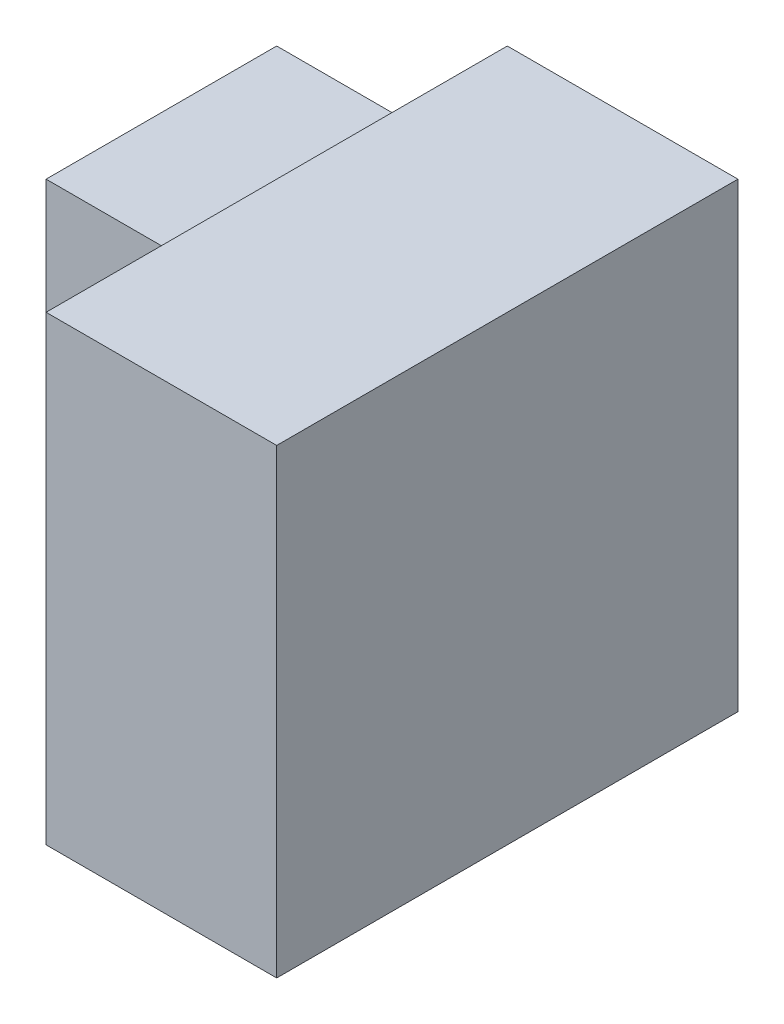
ISO-10303-21;
HEADER;
FILE_DESCRIPTION(('STEP AP214'),'2;1');
FILE_NAME('part.step','',(''),(''),'','','');
FILE_SCHEMA(('AUTOMOTIVE_DESIGN { 1 0 10303 214 1 1 1 1 }'));
ENDSEC;
DATA;
#1=APPLICATION_CONTEXT('core data for automotive mechanical design processes');
#2=APPLICATION_PROTOCOL_DEFINITION('international standard','automotive_design',2000,#1);
#3=PRODUCT_CONTEXT('',#1,'mechanical');
#4=PRODUCT('Part','Part','',(#3));
#5=PRODUCT_RELATED_PRODUCT_CATEGORY('part','',(#4));
#6=PRODUCT_DEFINITION_FORMATION('','',#4);
#7=PRODUCT_DEFINITION_CONTEXT('part definition',#1,'design');
#8=PRODUCT_DEFINITION('design','',#6,#7);
#9=PRODUCT_DEFINITION_SHAPE('','',#8);
#10=(LENGTH_UNIT() NAMED_UNIT(*) SI_UNIT(.MILLI.,.METRE.));
#11=(NAMED_UNIT(*) PLANE_ANGLE_UNIT() SI_UNIT($,.RADIAN.));
#12=(NAMED_UNIT(*) SI_UNIT($,.STERADIAN.) SOLID_ANGLE_UNIT());
#13=UNCERTAINTY_MEASURE_WITH_UNIT(LENGTH_MEASURE(1.E-05),#10,'distance_accuracy_value','');
#14=(GEOMETRIC_REPRESENTATION_CONTEXT(3) GLOBAL_UNCERTAINTY_ASSIGNED_CONTEXT((#13)) GLOBAL_UNIT_ASSIGNED_CONTEXT((#10,
#11,#12)) REPRESENTATION_CONTEXT('',''));
#15=CARTESIAN_POINT('',(0.,0.,0.));
#16=DIRECTION('',(0.,0.,1.));
#17=DIRECTION('',(1.,0.,0.));
#18=AXIS2_PLACEMENT_3D('',#15,#16,#17);
#19=CARTESIAN_POINT('',(2.,0.,0.));
#20=DIRECTION('',(0.,0.,-1.));
#21=DIRECTION('',(-1.,0.,0.));
#22=AXIS2_PLACEMENT_3D('',#19,#20,#21);
#23=PLANE('',#22);
#24=DIRECTION('',(0.,-1.,0.));
#25=VECTOR('',#24,1.);
#26=CARTESIAN_POINT('',(0.,0.,0.));
#27=LINE('',#26,#25);
#28=CARTESIAN_POINT('',(0.,4.,0.));
#29=VERTEX_POINT('',#28);
#30=CARTESIAN_POINT('',(0.,0.,0.));
#31=VERTEX_POINT('',#30);
#32=EDGE_CURVE('E133',#29,#31,#27,.T.);
#33=ORIENTED_EDGE('',*,*,#32,.T.);
#34=DIRECTION('',(-1.,0.,0.));
#35=VECTOR('',#34,1.);
#36=CARTESIAN_POINT('',(2.,0.,0.));
#37=LINE('',#36,#35);
#38=CARTESIAN_POINT('',(2.,0.,0.));
#39=VERTEX_POINT('',#38);
#40=EDGE_CURVE('E11',#39,#31,#37,.T.);
#41=ORIENTED_EDGE('',*,*,#40,.F.);
#42=DIRECTION('',(0.,-1.,0.));
#43=VECTOR('',#42,1.);
#44=CARTESIAN_POINT('',(2.,0.,0.));
#45=LINE('',#44,#43);
#46=CARTESIAN_POINT('',(2.,4.,0.));
#47=VERTEX_POINT('',#46);
#48=EDGE_CURVE('E151',#47,#39,#45,.T.);
#49=ORIENTED_EDGE('',*,*,#48,.F.);
#50=DIRECTION('',(-1.,0.,0.));
#51=VECTOR('',#50,1.);
#52=CARTESIAN_POINT('',(2.,4.,0.));
#53=LINE('',#52,#51);
#54=EDGE_CURVE('E152',#47,#29,#53,.T.);
#55=ORIENTED_EDGE('',*,*,#54,.T.);
#56=EDGE_LOOP('',(#33,#41,#49,#55));
#57=FACE_BOUND('',#56,.T.);
#58=ADVANCED_FACE('F33',(#57),#23,.F.);
#59=CARTESIAN_POINT('',(2.,0.,0.));
#60=DIRECTION('',(0.,1.,0.));
#61=DIRECTION('',(0.,0.,1.));
#62=AXIS2_PLACEMENT_3D('',#59,#60,#61);
#63=PLANE('',#62);
#64=DIRECTION('',(0.,0.,-1.));
#65=VECTOR('',#64,1.);
#66=CARTESIAN_POINT('',(0.,0.,0.));
#67=LINE('',#66,#65);
#68=CARTESIAN_POINT('',(0.,0.,-2.));
#69=VERTEX_POINT('',#68);
#70=EDGE_CURVE('E136',#31,#69,#67,.T.);
#71=ORIENTED_EDGE('',*,*,#70,.T.);
#72=DIRECTION('',(1.,0.,0.));
#73=VECTOR('',#72,1.);
#74=CARTESIAN_POINT('',(-2.,0.,-2.));
#75=LINE('',#74,#73);
#76=CARTESIAN_POINT('',(-2.,0.,-2.));
#77=VERTEX_POINT('',#76);
#78=EDGE_CURVE('E107',#77,#69,#75,.T.);
#79=ORIENTED_EDGE('',*,*,#78,.F.);
#80=DIRECTION('',(0.,0.,1.));
#81=VECTOR('',#80,1.);
#82=CARTESIAN_POINT('',(-2.,0.,-4.));
#83=LINE('',#82,#81);
#84=CARTESIAN_POINT('',(-2.,0.,-4.));
#85=VERTEX_POINT('',#84);
#86=EDGE_CURVE('E104',#85,#77,#83,.T.);
#87=ORIENTED_EDGE('',*,*,#86,.F.);
#88=DIRECTION('',(-1.,0.,0.));
#89=VECTOR('',#88,1.);
#90=CARTESIAN_POINT('',(2.,0.,-4.));
#91=LINE('',#90,#89);
#92=CARTESIAN_POINT('',(2.,0.,-4.));
#93=VERTEX_POINT('',#92);
#94=EDGE_CURVE('E41',#93,#85,#91,.T.);
#95=ORIENTED_EDGE('',*,*,#94,.F.);
#96=DIRECTION('',(0.,0.,-1.));
#97=VECTOR('',#96,1.);
#98=CARTESIAN_POINT('',(2.,0.,0.));
#99=LINE('',#98,#97);
#100=EDGE_CURVE('E168',#39,#93,#99,.T.);
#101=ORIENTED_EDGE('',*,*,#100,.F.);
#102=ORIENTED_EDGE('',*,*,#40,.T.);
#103=EDGE_LOOP('',(#71,#79,#87,#95,#101,#102));
#104=FACE_BOUND('',#103,.T.);
#105=ADVANCED_FACE('F105',(#104),#63,.F.);
#106=CARTESIAN_POINT('',(2.,0.,-4.));
#107=DIRECTION('',(0.,0.,1.));
#108=DIRECTION('',(1.,0.,0.));
#109=AXIS2_PLACEMENT_3D('',#106,#107,#108);
#110=PLANE('',#109);
#111=ORIENTED_EDGE('',*,*,#94,.T.);
#112=DIRECTION('',(0.,-1.,0.));
#113=VECTOR('',#112,1.);
#114=CARTESIAN_POINT('',(-2.,0.,-4.));
#115=LINE('',#114,#113);
#116=CARTESIAN_POINT('',(-2.,3.,-4.));
#117=VERTEX_POINT('',#116);
#118=EDGE_CURVE('E97',#117,#85,#115,.T.);
#119=ORIENTED_EDGE('',*,*,#118,.F.);
#120=DIRECTION('',(1.,0.,0.));
#121=VECTOR('',#120,1.);
#122=CARTESIAN_POINT('',(-2.,3.,-4.));
#123=LINE('',#122,#121);
#124=CARTESIAN_POINT('',(0.,3.,-4.));
#125=VERTEX_POINT('',#124);
#126=EDGE_CURVE('E122',#117,#125,#123,.T.);
#127=ORIENTED_EDGE('',*,*,#126,.T.);
#128=DIRECTION('',(0.,1.,0.));
#129=VECTOR('',#128,1.);
#130=CARTESIAN_POINT('',(0.,0.,-4.));
#131=LINE('',#130,#129);
#132=CARTESIAN_POINT('',(0.,4.,-4.));
#133=VERTEX_POINT('',#132);
#134=EDGE_CURVE('E55',#125,#133,#131,.T.);
#135=ORIENTED_EDGE('',*,*,#134,.T.);
#136=DIRECTION('',(-1.,0.,0.));
#137=VECTOR('',#136,1.);
#138=CARTESIAN_POINT('',(2.,4.,-4.));
#139=LINE('',#138,#137);
#140=CARTESIAN_POINT('',(2.,4.,-4.));
#141=VERTEX_POINT('',#140);
#142=EDGE_CURVE('E101',#141,#133,#139,.T.);
#143=ORIENTED_EDGE('',*,*,#142,.F.);
#144=DIRECTION('',(0.,1.,0.));
#145=VECTOR('',#144,1.);
#146=CARTESIAN_POINT('',(2.,0.,-4.));
#147=LINE('',#146,#145);
#148=EDGE_CURVE('E99',#93,#141,#147,.T.);
#149=ORIENTED_EDGE('',*,*,#148,.F.);
#150=EDGE_LOOP('',(#111,#119,#127,#135,#143,#149));
#151=FACE_BOUND('',#150,.T.);
#152=ADVANCED_FACE('F94',(#151),#110,.F.);
#153=CARTESIAN_POINT('',(2.,4.,0.));
#154=DIRECTION('',(0.,-1.,0.));
#155=DIRECTION('',(0.,0.,-1.));
#156=AXIS2_PLACEMENT_3D('',#153,#154,#155);
#157=PLANE('',#156);
#158=DIRECTION('',(0.,0.,1.));
#159=VECTOR('',#158,1.);
#160=CARTESIAN_POINT('',(0.,4.,0.));
#161=LINE('',#160,#159);
#162=EDGE_CURVE('E149',#133,#29,#161,.T.);
#163=ORIENTED_EDGE('',*,*,#162,.T.);
#164=ORIENTED_EDGE('',*,*,#54,.F.);
#165=DIRECTION('',(0.,0.,1.));
#166=VECTOR('',#165,1.);
#167=CARTESIAN_POINT('',(2.,4.,0.));
#168=LINE('',#167,#166);
#169=EDGE_CURVE('E155',#141,#47,#168,.T.);
#170=ORIENTED_EDGE('',*,*,#169,.F.);
#171=ORIENTED_EDGE('',*,*,#142,.T.);
#172=EDGE_LOOP('',(#163,#164,#170,#171));
#173=FACE_BOUND('',#172,.T.);
#174=ADVANCED_FACE('F159',(#173),#157,.F.);
#175=CARTESIAN_POINT('',(2.,0.,0.));
#176=DIRECTION('',(-1.,0.,0.));
#177=DIRECTION('',(0.,0.,1.));
#178=AXIS2_PLACEMENT_3D('',#175,#176,#177);
#179=PLANE('',#178);
#180=ORIENTED_EDGE('',*,*,#48,.T.);
#181=ORIENTED_EDGE('',*,*,#100,.T.);
#182=ORIENTED_EDGE('',*,*,#148,.T.);
#183=ORIENTED_EDGE('',*,*,#169,.T.);
#184=EDGE_LOOP('',(#180,#181,#182,#183));
#185=FACE_BOUND('',#184,.T.);
#186=ADVANCED_FACE('F171',(#185),#179,.F.);
#187=CARTESIAN_POINT('',(0.,0.,0.));
#188=DIRECTION('',(-1.,0.,0.));
#189=DIRECTION('',(0.,0.,1.));
#190=AXIS2_PLACEMENT_3D('',#187,#188,#189);
#191=PLANE('',#190);
#192=DIRECTION('',(0.,0.,-1.));
#193=VECTOR('',#192,1.);
#194=CARTESIAN_POINT('',(0.,3.,-4.));
#195=LINE('',#194,#193);
#196=CARTESIAN_POINT('',(0.,3.,-2.));
#197=VERTEX_POINT('',#196);
#198=EDGE_CURVE('E116',#197,#125,#195,.T.);
#199=ORIENTED_EDGE('',*,*,#198,.F.);
#200=DIRECTION('',(0.,1.,0.));
#201=VECTOR('',#200,1.);
#202=CARTESIAN_POINT('',(0.,0.,-2.));
#203=LINE('',#202,#201);
#204=EDGE_CURVE('E49',#69,#197,#203,.T.);
#205=ORIENTED_EDGE('',*,*,#204,.F.);
#206=ORIENTED_EDGE('',*,*,#70,.F.);
#207=ORIENTED_EDGE('',*,*,#32,.F.);
#208=ORIENTED_EDGE('',*,*,#162,.F.);
#209=ORIENTED_EDGE('',*,*,#134,.F.);
#210=EDGE_LOOP('',(#199,#205,#206,#207,#208,#209));
#211=FACE_BOUND('',#210,.T.);
#212=ADVANCED_FACE('F162',(#211),#191,.T.);
#213=CARTESIAN_POINT('',(-2.,0.,-2.));
#214=DIRECTION('',(0.,0.,-1.));
#215=DIRECTION('',(-1.,0.,0.));
#216=AXIS2_PLACEMENT_3D('',#213,#214,#215);
#217=PLANE('',#216);
#218=ORIENTED_EDGE('',*,*,#204,.T.);
#219=DIRECTION('',(1.,0.,0.));
#220=VECTOR('',#219,1.);
#221=CARTESIAN_POINT('',(-2.,3.,-2.));
#222=LINE('',#221,#220);
#223=CARTESIAN_POINT('',(-2.,3.,-2.));
#224=VERTEX_POINT('',#223);
#225=EDGE_CURVE('E125',#224,#197,#222,.T.);
#226=ORIENTED_EDGE('',*,*,#225,.F.);
#227=DIRECTION('',(0.,1.,0.));
#228=VECTOR('',#227,1.);
#229=CARTESIAN_POINT('',(-2.,0.,-2.));
#230=LINE('',#229,#228);
#231=EDGE_CURVE('E110',#77,#224,#230,.T.);
#232=ORIENTED_EDGE('',*,*,#231,.F.);
#233=ORIENTED_EDGE('',*,*,#78,.T.);
#234=EDGE_LOOP('',(#218,#226,#232,#233));
#235=FACE_BOUND('',#234,.T.);
#236=ADVANCED_FACE('F178',(#235),#217,.F.);
#237=CARTESIAN_POINT('',(-2.,3.,-4.));
#238=DIRECTION('',(0.,-1.,0.));
#239=DIRECTION('',(0.,0.,-1.));
#240=AXIS2_PLACEMENT_3D('',#237,#238,#239);
#241=PLANE('',#240);
#242=ORIENTED_EDGE('',*,*,#198,.T.);
#243=ORIENTED_EDGE('',*,*,#126,.F.);
#244=DIRECTION('',(0.,0.,-1.));
#245=VECTOR('',#244,1.);
#246=CARTESIAN_POINT('',(-2.,3.,-4.));
#247=LINE('',#246,#245);
#248=EDGE_CURVE('E114',#224,#117,#247,.T.);
#249=ORIENTED_EDGE('',*,*,#248,.F.);
#250=ORIENTED_EDGE('',*,*,#225,.T.);
#251=EDGE_LOOP('',(#242,#243,#249,#250));
#252=FACE_BOUND('',#251,.T.);
#253=ADVANCED_FACE('F228',(#252),#241,.F.);
#254=CARTESIAN_POINT('',(-2.,0.,0.));
#255=DIRECTION('',(1.,0.,0.));
#256=DIRECTION('',(0.,0.,-1.));
#257=AXIS2_PLACEMENT_3D('',#254,#255,#256);
#258=PLANE('',#257);
#259=ORIENTED_EDGE('',*,*,#118,.T.);
#260=ORIENTED_EDGE('',*,*,#86,.T.);
#261=ORIENTED_EDGE('',*,*,#231,.T.);
#262=ORIENTED_EDGE('',*,*,#248,.T.);
#263=EDGE_LOOP('',(#259,#260,#261,#262));
#264=FACE_BOUND('',#263,.T.);
#265=ADVANCED_FACE('F112',(#264),#258,.F.);
#266=CLOSED_SHELL('',(#58,#105,#152,#174,#186,#212,#236,#253,#265));
#267=MANIFOLD_SOLID_BREP('B2',#266);
#268=ADVANCED_BREP_SHAPE_REPRESENTATION('',(#18,#267),#14);
#269=SHAPE_DEFINITION_REPRESENTATION(#9,#268);
ENDSEC;
END-ISO-10303-21;
